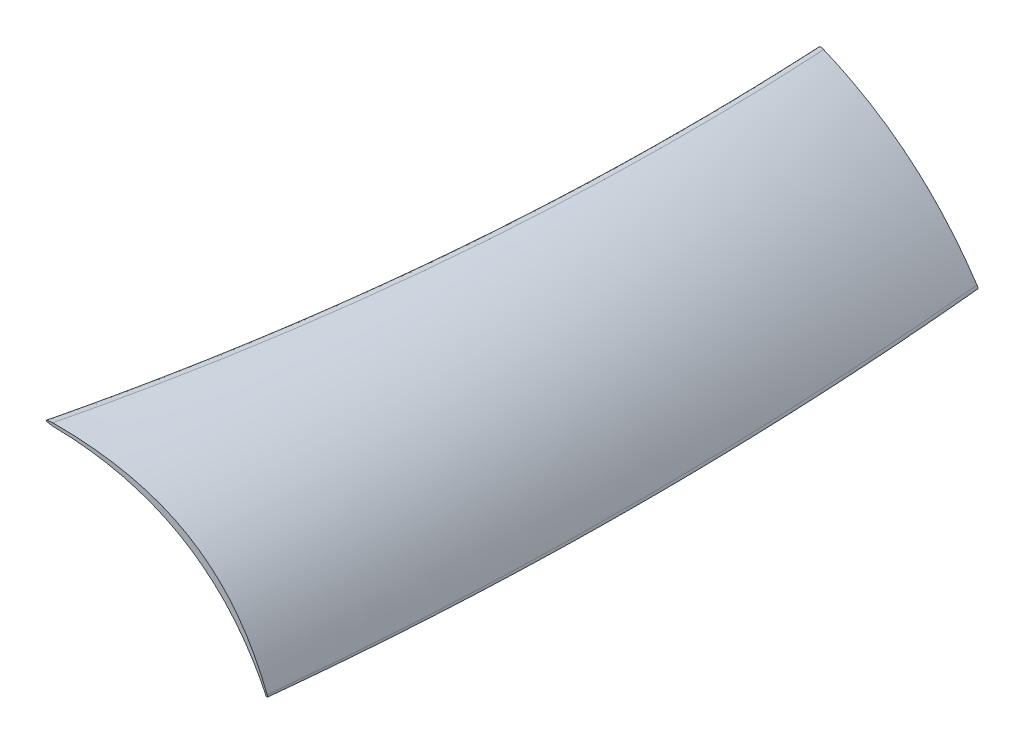
ISO-10303-21;
HEADER;
FILE_DESCRIPTION(('STEP AP214'),'2;1');
FILE_NAME('part.step','',(''),(''),'','','');
FILE_SCHEMA(('AUTOMOTIVE_DESIGN { 1 0 10303 214 1 1 1 1 }'));
ENDSEC;
DATA;
#1=APPLICATION_CONTEXT('core data for automotive mechanical design processes');
#2=APPLICATION_PROTOCOL_DEFINITION('international standard','automotive_design',2000,#1);
#3=PRODUCT_CONTEXT('',#1,'mechanical');
#4=PRODUCT('Part','Part','',(#3));
#5=PRODUCT_RELATED_PRODUCT_CATEGORY('part','',(#4));
#6=PRODUCT_DEFINITION_FORMATION('','',#4);
#7=PRODUCT_DEFINITION_CONTEXT('part definition',#1,'design');
#8=PRODUCT_DEFINITION('design','',#6,#7);
#9=PRODUCT_DEFINITION_SHAPE('','',#8);
#10=(LENGTH_UNIT() NAMED_UNIT(*) SI_UNIT(.MILLI.,.METRE.));
#11=(NAMED_UNIT(*) PLANE_ANGLE_UNIT() SI_UNIT($,.RADIAN.));
#12=(NAMED_UNIT(*) SI_UNIT($,.STERADIAN.) SOLID_ANGLE_UNIT());
#13=UNCERTAINTY_MEASURE_WITH_UNIT(LENGTH_MEASURE(1.E-05),#10,'distance_accuracy_value','');
#14=(GEOMETRIC_REPRESENTATION_CONTEXT(3) GLOBAL_UNCERTAINTY_ASSIGNED_CONTEXT((#13)) GLOBAL_UNIT_ASSIGNED_CONTEXT((#10,
#11,#12)) REPRESENTATION_CONTEXT('',''));
#15=CARTESIAN_POINT('',(0.,0.,0.));
#16=DIRECTION('',(0.,0.,1.));
#17=DIRECTION('',(1.,0.,0.));
#18=AXIS2_PLACEMENT_3D('',#15,#16,#17);
#19=CARTESIAN_POINT('',(-7.91704261697737,4.65306524449419,55.));
#20=DIRECTION('',(0.,0.,-1.));
#21=DIRECTION('',(-1.,0.,0.));
#22=AXIS2_PLACEMENT_3D('',#19,#20,#21);
#23=PLANE('',#22);
#24=CARTESIAN_POINT('',(-7.53161092049213,4.73224653927621,55.));
#25=CARTESIAN_POINT('',(-8.04720006384225,4.68256101728748,55.));
#26=CARTESIAN_POINT('',(-8.04551984913911,4.62667147956685,55.));
#27=CARTESIAN_POINT('',(-7.52657027638272,4.56457792611432,55.));
#28=B_SPLINE_CURVE_WITH_KNOTS('',3,(#24,#25,#26,#27),.UNSPECIFIED.,.F.,.F.,(4,4),(0.,1.),.UNSPECIFIED.);
#29=CARTESIAN_POINT('',(-7.53161092049213,4.73224653927621,55.));
#30=VERTEX_POINT('',#29);
#31=CARTESIAN_POINT('',(-7.52657027638272,4.56457792611432,55.));
#32=VERTEX_POINT('',#31);
#33=EDGE_CURVE('E267',#30,#32,#28,.T.);
#34=ORIENTED_EDGE('',*,*,#33,.T.);
#35=CARTESIAN_POINT('',(-7.52657027638272,4.56457792611432,55.));
#36=CARTESIAN_POINT('',(1.07610495930104,4.45407874377158,55.));
#37=CARTESIAN_POINT('',(4.4454838373055,-2.50516567989444,55.));
#38=B_SPLINE_CURVE_WITH_KNOTS('',2,(#35,#36,#37),.UNSPECIFIED.,.F.,.F.,(3,3),(0.,1.),.UNSPECIFIED.);
#39=CARTESIAN_POINT('',(4.4454838373055,-2.50516567989444,55.));
#40=VERTEX_POINT('',#39);
#41=EDGE_CURVE('E253',#32,#40,#38,.T.);
#42=ORIENTED_EDGE('',*,*,#41,.T.);
#43=CARTESIAN_POINT('',(4.4454838373055,-2.50516567989444,55.));
#44=CARTESIAN_POINT('',(4.48343021389558,-2.68304511494366,55.));
#45=CARTESIAN_POINT('',(4.6139546566677,-2.65393543407828,55.));
#46=CARTESIAN_POINT('',(4.54641178943805,-2.50516567989444,55.));
#47=B_SPLINE_CURVE_WITH_KNOTS('',3,(#43,#44,#45,#46),.UNSPECIFIED.,.F.,.F.,(4,4),(0.,1.),.UNSPECIFIED.);
#48=CARTESIAN_POINT('',(4.54641178943805,-2.50516567989444,55.));
#49=VERTEX_POINT('',#48);
#50=EDGE_CURVE('E120',#40,#49,#47,.T.);
#51=ORIENTED_EDGE('',*,*,#50,.T.);
#52=CARTESIAN_POINT('',(4.54641178943805,-2.50516567989444,55.));
#53=CARTESIAN_POINT('',(2.4837692215193,2.75657990053807,55.));
#54=CARTESIAN_POINT('',(-1.43952431167045,4.73224653927621,55.));
#55=CARTESIAN_POINT('',(-7.53161092049213,4.73224653927621,55.));
#56=B_SPLINE_CURVE_WITH_KNOTS('',3,(#52,#53,#54,#55),.UNSPECIFIED.,.F.,.F.,(4,4),(0.,1.),.UNSPECIFIED.);
#57=EDGE_CURVE('E13',#49,#30,#56,.T.);
#58=ORIENTED_EDGE('',*,*,#57,.T.);
#59=EDGE_LOOP('',(#34,#42,#51,#58));
#60=FACE_BOUND('',#59,.T.);
#61=ADVANCED_FACE('F109',(#60),#23,.F.);
#62=CARTESIAN_POINT('',(-4.36189239817565,4.64295842244128,15.));
#63=DIRECTION('',(0.,0.,1.));
#64=DIRECTION('',(1.,0.,0.));
#65=AXIS2_PLACEMENT_3D('',#62,#63,#64);
#66=PLANE('',#65);
#67=CARTESIAN_POINT('',(-4.08721732582229,4.66339436299082,15.));
#68=CARTESIAN_POINT('',(-4.22208353592139,4.72839232305185,15.));
#69=CARTESIAN_POINT('',(-4.49812520318032,4.66804774978695,15.));
#70=CARTESIAN_POINT('',(-4.23332571562765,4.52878036126196,15.));
#71=CARTESIAN_POINT('',(-4.08721732582229,4.45193680662429,15.));
#72=B_SPLINE_CURVE_WITH_KNOTS('',3,(#67,#68,#69,#70,#71),.UNSPECIFIED.,.F.,.F.,(4,1,4),(0.,
0.448230088525771,1.),.UNSPECIFIED.);
#73=CARTESIAN_POINT('',(-4.08721732582229,4.66339436299082,15.));
#74=VERTEX_POINT('',#73);
#75=CARTESIAN_POINT('',(-4.08721732582229,4.45193680662429,15.));
#76=VERTEX_POINT('',#75);
#77=EDGE_CURVE('E224',#74,#76,#72,.T.);
#78=ORIENTED_EDGE('',*,*,#77,.F.);
#79=CARTESIAN_POINT('',(-613569.064529268,-789661.941886145,15.));
#80=CARTESIAN_POINT('',(618330.870492432,785920.251661708,15.));
#81=CARTESIAN_POINT('',(-623091.141380953,-782170.334678179,15.));
#82=B_SPLINE_CURVE_WITH_KNOTS('',2,(#79,#80,#81),.UNSPECIFIED.,.F.,.F.,(3,3),(0.,1.),.UNSPECIFIED.);
#83=CARTESIAN_POINT('',(4.54641178943805,-2.50516567989444,15.));
#84=VERTEX_POINT('',#83);
#85=EDGE_CURVE('E180',#84,#74,#82,.T.);
#86=ORIENTED_EDGE('',*,*,#85,.F.);
#87=CARTESIAN_POINT('',(4.35167047174066,-2.50516567989444,15.));
#88=CARTESIAN_POINT('',(4.53850866525187,-2.76587501253457,15.));
#89=CARTESIAN_POINT('',(4.69452804060496,-2.71001189954286,15.));
#90=CARTESIAN_POINT('',(4.54641178943805,-2.50516567989444,15.));
#91=B_SPLINE_CURVE_WITH_KNOTS('',3,(#87,#88,#89,#90),.UNSPECIFIED.,.F.,.F.,(4,4),(0.,1.),.UNSPECIFIED.);
#92=CARTESIAN_POINT('',(4.35167047174066,-2.50516567989444,15.));
#93=VERTEX_POINT('',#92);
#94=EDGE_CURVE('E156',#93,#84,#91,.T.);
#95=ORIENTED_EDGE('',*,*,#94,.F.);
#96=CARTESIAN_POINT('',(-4.08721732582229,4.45193680662429,15.));
#97=CARTESIAN_POINT('',(0.885378065094373,1.90519099081301,15.));
#98=CARTESIAN_POINT('',(4.35167047174066,-2.50516567989444,15.));
#99=B_SPLINE_CURVE_WITH_KNOTS('',2,(#96,#97,#98),.UNSPECIFIED.,.F.,.F.,(3,3),(0.,1.),.UNSPECIFIED.);
#100=EDGE_CURVE('E165',#76,#93,#99,.T.);
#101=ORIENTED_EDGE('',*,*,#100,.F.);
#102=EDGE_LOOP('',(#78,#86,#95,#101));
#103=FACE_BOUND('',#102,.T.);
#104=ADVANCED_FACE('F179',(#103),#66,.F.);
#105=CARTESIAN_POINT('',(4.35167047174066,-2.50516567989444,15.));
#106=CARTESIAN_POINT('',(5.34421165070914,-2.89681375937998,28.3285491942416));
#107=CARTESIAN_POINT('',(5.37548277256409,-2.89681375937998,41.6618825275749));
#108=CARTESIAN_POINT('',(4.4454838373055,-2.50516567989444,55.));
#109=CARTESIAN_POINT('',(4.39838002011846,-2.57034301305447,15.));
#110=CARTESIAN_POINT('',(5.37697711371738,-2.95515433166206,28.3282219843637));
#111=CARTESIAN_POINT('',(5.39584058416224,-2.94825184019615,41.661555317697));
#112=CARTESIAN_POINT('',(4.45497043145302,-2.54963553865674,55.));
#113=CARTESIAN_POINT('',(4.48794676460431,-2.66112612367056,15.));
#114=CARTESIAN_POINT('',(5.44379722431161,-3.03682989259379,28.3275675646079));
#115=CARTESIAN_POINT('',(5.44298692878378,-3.02068839026761,41.6609008979413));
#116=CARTESIAN_POINT('',(4.48551587802082,-2.61270161669203,55.));
#117=CARTESIAN_POINT('',(4.58511637373984,-2.69429762301166,15.));
#118=CARTESIAN_POINT('',(5.5217299754078,-3.06752984936117,28.3265859349743));
#119=CARTESIAN_POINT('',(5.50629212371903,-3.0487196126974,41.6599192683076));
#120=CARTESIAN_POINT('',(4.53880281867354,-2.63786691302037,55.));
#121=CARTESIAN_POINT('',(4.61948202449824,-2.64017745629867,15.));
#122=CARTESIAN_POINT('',(5.55120034318051,-3.01961978776541,28.3256043053406));
#123=CARTESIAN_POINT('',(5.53547651038445,-3.00682246445503,41.658937638674));
#124=CARTESIAN_POINT('',(4.57231052611007,-2.60178548636751,55.));
#125=CARTESIAN_POINT('',(4.58344085222978,-2.55637723480654,15.));
#126=CARTESIAN_POINT('',(5.52109568712773,-2.94407531197087,28.3249498855849));
#127=CARTESIAN_POINT('',(5.51438123846629,-2.93940227318215,41.6582832189182));
#128=CARTESIAN_POINT('',(4.56329750624546,-2.5423581184404,55.));
#129=CARTESIAN_POINT('',(4.54641178943805,-2.50516567989444,15.));
#130=CARTESIAN_POINT('',(5.48924463903797,-2.89760252643543,28.324622675707));
#131=CARTESIAN_POINT('',(5.48924463903797,-2.89760252643543,41.6579560090403));
#132=CARTESIAN_POINT('',(4.54641178943805,-2.50516567989444,55.));
#133=B_SPLINE_SURFACE_WITH_KNOTS('',3,3,((#105,#106,#107,#108),(#109,#110,#111,#112),(#113,#114,
#115,#116),(#117,#118,#119,#120),(#121,#122,#123,#124),(#125,#126,#127,#128),(#129,#130,#131,
#132)),.UNSPECIFIED.,.F.,.F.,.F.,(4,1,1,1,4),(4,4),(0.969965394692638,0.977474046019478,
0.984982697346319,0.992491348673159,1.),(0.,1.),.UNSPECIFIED.);
#134=CARTESIAN_POINT('',(4.54641178943805,-2.50516567989444,15.));
#135=CARTESIAN_POINT('',(5.48924463903797,-2.89760252643543,28.324622675707));
#136=CARTESIAN_POINT('',(5.48924463903797,-2.89760252643543,41.6579560090403));
#137=CARTESIAN_POINT('',(4.54641178943805,-2.50516567989444,55.));
#138=B_SPLINE_CURVE_WITH_KNOTS('',3,(#134,#135,#136,#137),.UNSPECIFIED.,.F.,.F.,(4,4),(0.,1.),.UNSPECIFIED.);
#139=EDGE_CURVE('E128',#84,#49,#138,.T.);
#140=CARTESIAN_POINT('',(4.35167047174066,-2.50516567989444,15.));
#141=CARTESIAN_POINT('',(5.34421165070914,-2.89681375937998,28.3285491942416));
#142=CARTESIAN_POINT('',(5.37548277256409,-2.89681375937998,41.6618825275749));
#143=CARTESIAN_POINT('',(4.4454838373055,-2.50516567989444,55.));
#144=B_SPLINE_CURVE_WITH_KNOTS('',3,(#140,#141,#142,#143),.UNSPECIFIED.,.F.,.F.,(4,4),(0.,1.),.UNSPECIFIED.);
#145=EDGE_CURVE('E152',#93,#40,#144,.T.);
#146=ORIENTED_EDGE('',*,*,#94,.T.);
#147=ORIENTED_EDGE('',*,*,#139,.T.);
#148=ORIENTED_EDGE('',*,*,#50,.F.);
#149=ORIENTED_EDGE('',*,*,#145,.F.);
#150=EDGE_LOOP('',(#146,#147,#148,#149));
#151=FACE_BOUND('',#150,.T.);
#152=ADVANCED_FACE('F154',(#151),#133,.T.);
#153=CARTESIAN_POINT('',(-4.08721732582229,4.45193680662429,15.));
#154=CARTESIAN_POINT('',(-3.70898233830242,4.12193941233324,28.4485382450289));
#155=CARTESIAN_POINT('',(-4.85543332182256,4.15948645216326,41.7818715783623));
#156=CARTESIAN_POINT('',(-7.52657027638272,4.56457792611432,55.));
#157=CARTESIAN_POINT('',(-3.25845142733618,4.02747917065574,15.));
#158=CARTESIAN_POINT('',(-2.72549666348978,3.83082017444368,28.4385391574633));
#159=CARTESIAN_POINT('',(-3.67027654452286,4.00371424946639,41.7718724907966));
#160=CARTESIAN_POINT('',(-6.09279107043542,4.54616139572386,55.));
#161=CARTESIAN_POINT('',(-1.66368225470856,3.10091344643131,15.));
#162=CARTESIAN_POINT('',(-0.873051735062025,3.10169326878797,28.4185409823321));
#163=CARTESIAN_POINT('',(-1.46625320797389,3.4760434366068,41.7518743156655));
#164=CARTESIAN_POINT('',(-3.44328667344414,4.22396394988782,55.));
#165=CARTESIAN_POINT('',(0.540183631199077,1.47811350323264,15.));
#166=CARTESIAN_POINT('',(1.56203639398712,1.56733762067456,28.3885437196352));
#167=CARTESIAN_POINT('',(1.34091114269838,2.03615799491979,41.7218770529686));
#168=CARTESIAN_POINT('',(-0.123192122667127,2.88457462596832,55.));
#169=CARTESIAN_POINT('',(2.55576164407292,-0.377637796828058,15.));
#170=CARTESIAN_POINT('',(3.65354525944375,-0.407683317068649,28.3585464569384));
#171=CARTESIAN_POINT('',(3.64920483921944,-0.0521066691648183,41.6918797902717));
#172=CARTESIAN_POINT('',(2.54274038339996,0.689092146883435,55.));
#173=CARTESIAN_POINT('',(3.77395507063294,-1.77010623477653,15.));
#174=CARTESIAN_POINT('',(4.81883166068651,-2.018140801984,28.3385482818072));
#175=CARTESIAN_POINT('',(4.85548686746601,-1.87653592681964,41.6718816151405));
#176=CARTESIAN_POINT('',(3.88392069097142,-1.34529160928344,55.));
#177=CARTESIAN_POINT('',(4.35167047174066,-2.50516567989444,15.));
#178=CARTESIAN_POINT('',(5.34421165070914,-2.89681375937998,28.3285491942416));
#179=CARTESIAN_POINT('',(5.37548277256409,-2.89681375937998,41.6618825275749));
#180=CARTESIAN_POINT('',(4.4454838373055,-2.50516567989444,55.));
#181=B_SPLINE_SURFACE_WITH_KNOTS('',3,3,((#153,#154,#155,#156),(#157,#158,#159,#160),(#161,#162,
#163,#164),(#165,#166,#167,#168),(#169,#170,#171,#172),(#173,#174,#175,#176),(#177,#178,#179,
#180)),.UNSPECIFIED.,.F.,.F.,.F.,(4,1,1,1,4),(4,4),(0.0521488226237104,0.281602965640942,
0.511057108658174,0.740511251675406,0.969965394692638),(0.,1.),.UNSPECIFIED.);
#182=CARTESIAN_POINT('',(-4.08721732582229,4.45193680662429,15.));
#183=CARTESIAN_POINT('',(-3.70898233830242,4.12193941233324,28.4485382450289));
#184=CARTESIAN_POINT('',(-4.85543332182256,4.15948645216326,41.7818715783623));
#185=CARTESIAN_POINT('',(-7.52657027638272,4.56457792611432,55.));
#186=B_SPLINE_CURVE_WITH_KNOTS('',3,(#182,#183,#184,#185),.UNSPECIFIED.,.F.,.F.,(4,4),(0.,1.),.UNSPECIFIED.);
#187=EDGE_CURVE('E162',#76,#32,#186,.T.);
#188=ORIENTED_EDGE('',*,*,#100,.T.);
#189=ORIENTED_EDGE('',*,*,#145,.T.);
#190=ORIENTED_EDGE('',*,*,#41,.F.);
#191=ORIENTED_EDGE('',*,*,#187,.F.);
#192=EDGE_LOOP('',(#188,#189,#190,#191));
#193=FACE_BOUND('',#192,.T.);
#194=ADVANCED_FACE('F167',(#193),#181,.T.);
#195=CARTESIAN_POINT('',(-4.08721732582229,4.66339436299082,15.));
#196=CARTESIAN_POINT('',(-3.67865019078323,4.32017018364096,28.4553558248338));
#197=CARTESIAN_POINT('',(-4.82678138900651,4.34312090906943,41.7886891581671));
#198=CARTESIAN_POINT('',(-7.53161092049213,4.73224653927621,55.));
#199=CARTESIAN_POINT('',(-4.16243885464841,4.69964692708954,15.));
#200=CARTESIAN_POINT('',(-3.77443133546501,4.34008397209582,28.4547876931834));
#201=CARTESIAN_POINT('',(-4.94045445269209,4.34681004932565,41.7881210265167));
#202=CARTESIAN_POINT('',(-7.66050820632966,4.71982515877903,55.));
#203=CARTESIAN_POINT('',(-4.30756810033496,4.7143336090775,15.));
#204=CARTESIAN_POINT('',(-3.94089819359923,4.34110741754372,28.4536514298826));
#205=CARTESIAN_POINT('',(-5.12292352957026,4.33439851312395,41.7869847632159));
#206=CARTESIAN_POINT('',(-7.85364410824806,4.69420689581818,55.));
#207=CARTESIAN_POINT('',(-4.39513521963209,4.64653833451476,15.));
#208=CARTESIAN_POINT('',(-4.03918864488878,4.28198355205263,28.4519470349314));
#209=CARTESIAN_POINT('',(-5.22393422229665,4.28428843904019,41.7852803682647));
#210=CARTESIAN_POINT('',(-7.94937195185571,4.65345299547744,55.));
#211=CARTESIAN_POINT('',(-4.28457981378081,4.55680889457109,15.));
#212=CARTESIAN_POINT('',(-3.94073874298939,4.20746140767443,28.4502426399801));
#213=CARTESIAN_POINT('',(-5.12958673379357,4.22531597256314,41.7835759733135));
#214=CARTESIAN_POINT('',(-7.85112378619334,4.61037258923723,55.));
#215=CARTESIAN_POINT('',(-4.15341719771046,4.48675365375553,15.));
#216=CARTESIAN_POINT('',(-3.7936936871057,4.15043923398701,28.4491063766793));
#217=CARTESIAN_POINT('',(-4.96132384439282,4.18155512089432,41.7824397100127));
#218=CARTESIAN_POINT('',(-7.65630766957181,4.58010131447746,55.));
#219=CARTESIAN_POINT('',(-4.08721732582229,4.45193680662429,15.));
#220=CARTESIAN_POINT('',(-3.70898233830242,4.12193941233324,28.4485382450289));
#221=CARTESIAN_POINT('',(-4.85543332182256,4.15948645216326,41.7818715783623));
#222=CARTESIAN_POINT('',(-7.52657027638272,4.56457792611432,55.));
#223=B_SPLINE_SURFACE_WITH_KNOTS('',3,3,((#195,#196,#197,#198),(#199,#200,#201,#202),(#203,#204,
#205,#206),(#207,#208,#209,#210),(#211,#212,#213,#214),(#215,#216,#217,#218),(#219,#220,#221,
#222)),.UNSPECIFIED.,.F.,.F.,.F.,(4,1,1,1,4),(4,4),(0.,0.0130372056559276,0.0260744113118552,
0.0391116169677828,0.0521488226237104),(0.,1.),.UNSPECIFIED.);
#224=CARTESIAN_POINT('',(-4.08721732582229,4.66339436299082,15.));
#225=CARTESIAN_POINT('',(-3.67865019078323,4.32017018364096,28.4553558248338));
#226=CARTESIAN_POINT('',(-4.82678138900651,4.34312090906943,41.7886891581671));
#227=CARTESIAN_POINT('',(-7.53161092049213,4.73224653927621,55.));
#228=B_SPLINE_CURVE_WITH_KNOTS('',3,(#224,#225,#226,#227),.UNSPECIFIED.,.F.,.F.,(4,4),(0.,1.),.UNSPECIFIED.);
#229=EDGE_CURVE('E174',#74,#30,#228,.T.);
#230=ORIENTED_EDGE('',*,*,#77,.T.);
#231=ORIENTED_EDGE('',*,*,#187,.T.);
#232=ORIENTED_EDGE('',*,*,#33,.F.);
#233=ORIENTED_EDGE('',*,*,#229,.F.);
#234=EDGE_LOOP('',(#230,#231,#232,#233));
#235=FACE_BOUND('',#234,.T.);
#236=ADVANCED_FACE('F200',(#235),#223,.T.);
#237=CARTESIAN_POINT('',(4.54641178963944,-2.50516568002879,15.));
#238=CARTESIAN_POINT('',(5.48924463903797,-2.89760252643543,28.324622675707));
#239=CARTESIAN_POINT('',(5.48924463903797,-2.89760252643543,41.6579560090403));
#240=CARTESIAN_POINT('',(4.54641178943805,-2.50516567989444,55.));
#241=CARTESIAN_POINT('',(2.37529412943245,0.782667684567964,15.));
#242=CARTESIAN_POINT('',(3.55890717095877,1.05695555726034,28.3682003920826));
#243=CARTESIAN_POINT('',(3.59506553498273,1.71492629592249,41.7015337254159));
#244=CARTESIAN_POINT('',(2.4837692215193,2.75657990053807,55.));
#245=CARTESIAN_POINT('',(-0.502582242537356,3.17218769901374,15.));
#246=CARTESIAN_POINT('',(0.537180239947365,3.31727842695733,28.4117781084582));
#247=CARTESIAN_POINT('',(0.224866216825893,3.83729804043383,41.7451114417915));
#248=CARTESIAN_POINT('',(-1.43952431167045,4.73224653927621,55.));
#249=CARTESIAN_POINT('',(-4.08721732626997,4.66339436330853,15.));
#250=CARTESIAN_POINT('',(-3.67865019078323,4.32017018364096,28.4553558248338));
#251=CARTESIAN_POINT('',(-4.82678138900651,4.34312090906943,41.7886891581671));
#252=CARTESIAN_POINT('',(-7.53161092049213,4.73224653927621,55.));
#253=B_SPLINE_SURFACE_WITH_KNOTS('',3,3,((#237,#238,#239,#240),(#241,#242,#243,#244),(#245,#246,
#247,#248),(#249,#250,#251,#252)),.UNSPECIFIED.,.F.,.F.,.F.,(4,4),(4,4),(0.,1.),(0.,1.),.UNSPECIFIED.);
#254=ORIENTED_EDGE('',*,*,#85,.T.);
#255=ORIENTED_EDGE('',*,*,#229,.T.);
#256=ORIENTED_EDGE('',*,*,#57,.F.);
#257=ORIENTED_EDGE('',*,*,#139,.F.);
#258=EDGE_LOOP('',(#254,#255,#256,#257));
#259=FACE_BOUND('',#258,.T.);
#260=ADVANCED_FACE('F311',(#259),#253,.T.);
#261=CLOSED_SHELL('',(#61,#104,#152,#194,#236,#260));
#262=MANIFOLD_SOLID_BREP('B2',#261);
#263=ADVANCED_BREP_SHAPE_REPRESENTATION('',(#18,#262),#14);
#264=SHAPE_DEFINITION_REPRESENTATION(#9,#263);
ENDSEC;
END-ISO-10303-21;
